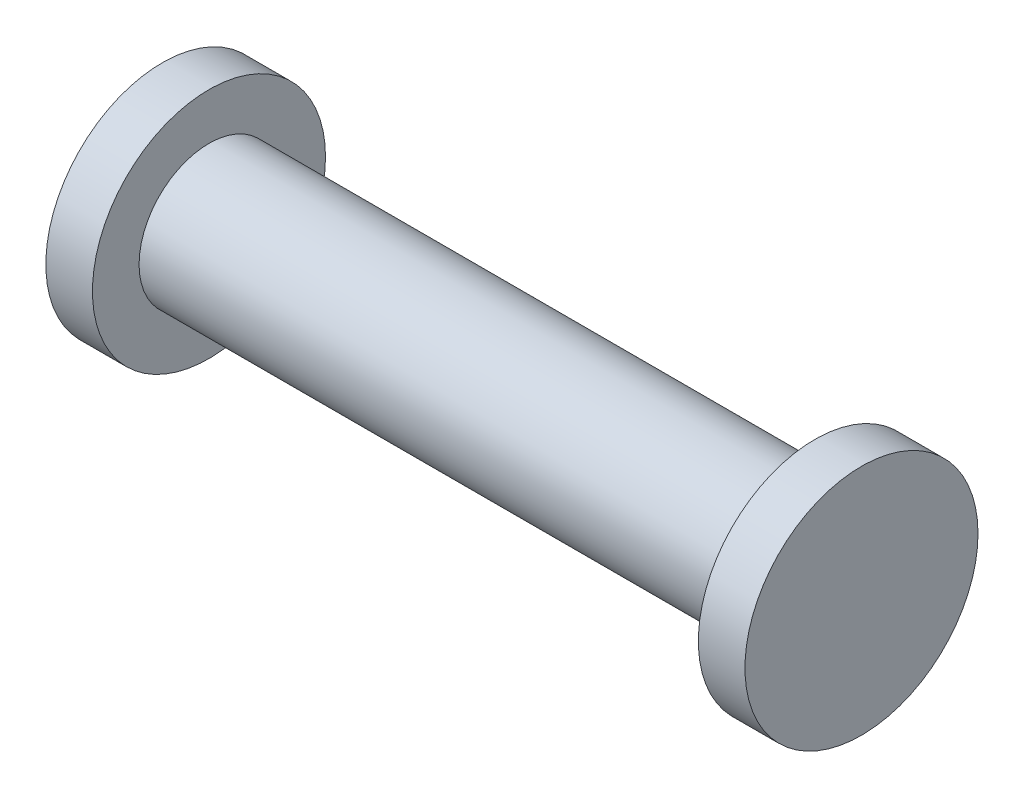
ISO-10303-21;
HEADER;
FILE_DESCRIPTION(('STEP AP214'),'2;1');
FILE_NAME('part.step','',(''),(''),'','','');
FILE_SCHEMA(('AUTOMOTIVE_DESIGN { 1 0 10303 214 1 1 1 1 }'));
ENDSEC;
DATA;
#1=APPLICATION_CONTEXT('core data for automotive mechanical design processes');
#2=APPLICATION_PROTOCOL_DEFINITION('international standard','automotive_design',2000,#1);
#3=PRODUCT_CONTEXT('',#1,'mechanical');
#4=PRODUCT('Part','Part','',(#3));
#5=PRODUCT_RELATED_PRODUCT_CATEGORY('part','',(#4));
#6=PRODUCT_DEFINITION_FORMATION('','',#4);
#7=PRODUCT_DEFINITION_CONTEXT('part definition',#1,'design');
#8=PRODUCT_DEFINITION('design','',#6,#7);
#9=PRODUCT_DEFINITION_SHAPE('','',#8);
#10=(LENGTH_UNIT() NAMED_UNIT(*) SI_UNIT(.MILLI.,.METRE.));
#11=(NAMED_UNIT(*) PLANE_ANGLE_UNIT() SI_UNIT($,.RADIAN.));
#12=(NAMED_UNIT(*) SI_UNIT($,.STERADIAN.) SOLID_ANGLE_UNIT());
#13=UNCERTAINTY_MEASURE_WITH_UNIT(LENGTH_MEASURE(1.E-05),#10,'distance_accuracy_value','');
#14=(GEOMETRIC_REPRESENTATION_CONTEXT(3) GLOBAL_UNCERTAINTY_ASSIGNED_CONTEXT((#13)) GLOBAL_UNIT_ASSIGNED_CONTEXT((#10,
#11,#12)) REPRESENTATION_CONTEXT('',''));
#15=CARTESIAN_POINT('',(0.,0.,0.));
#16=DIRECTION('',(0.,0.,1.));
#17=DIRECTION('',(1.,0.,0.));
#18=AXIS2_PLACEMENT_3D('',#15,#16,#17);
#19=CARTESIAN_POINT('',(32.5,0.,0.));
#20=DIRECTION('',(-1.,0.,0.));
#21=DIRECTION('',(0.,0.,1.));
#22=AXIS2_PLACEMENT_3D('',#19,#20,#21);
#23=CYLINDRICAL_SURFACE('',#22,7.5);
#24=CARTESIAN_POINT('',(32.5,0.,0.));
#25=DIRECTION('',(1.,0.,0.));
#26=DIRECTION('',(0.,0.,-1.));
#27=AXIS2_PLACEMENT_3D('',#24,#25,#26);
#28=CIRCLE('',#27,7.5);
#29=CARTESIAN_POINT('',(32.5,0.,-7.5));
#30=VERTEX_POINT('',#29);
#31=EDGE_CURVE('E10',#30,#30,#28,.T.);
#32=ORIENTED_EDGE('',*,*,#31,.F.);
#33=EDGE_LOOP('',(#32));
#34=FACE_BOUND('',#33,.T.);
#35=CARTESIAN_POINT('',(-32.5,0.,0.));
#36=DIRECTION('',(-1.,0.,0.));
#37=DIRECTION('',(0.,0.,1.));
#38=AXIS2_PLACEMENT_3D('',#35,#36,#37);
#39=CIRCLE('',#38,7.5);
#40=CARTESIAN_POINT('',(-32.5,0.,7.5));
#41=VERTEX_POINT('',#40);
#42=EDGE_CURVE('E45',#41,#41,#39,.T.);
#43=ORIENTED_EDGE('',*,*,#42,.F.);
#44=EDGE_LOOP('',(#43));
#45=FACE_BOUND('',#44,.T.);
#46=ADVANCED_FACE('F30',(#34,#45),#23,.T.);
#47=CARTESIAN_POINT('',(37.5,0.,0.));
#48=DIRECTION('',(-1.,0.,0.));
#49=DIRECTION('',(0.,0.,1.));
#50=AXIS2_PLACEMENT_3D('',#47,#48,#49);
#51=CYLINDRICAL_SURFACE('',#50,12.5);
#52=CARTESIAN_POINT('',(37.5,0.,0.));
#53=DIRECTION('',(1.,0.,0.));
#54=DIRECTION('',(0.,0.,-1.));
#55=AXIS2_PLACEMENT_3D('',#52,#53,#54);
#56=CIRCLE('',#55,12.5);
#57=CARTESIAN_POINT('',(37.5,0.,-12.5));
#58=VERTEX_POINT('',#57);
#59=EDGE_CURVE('E36',#58,#58,#56,.T.);
#60=ORIENTED_EDGE('',*,*,#59,.F.);
#61=EDGE_LOOP('',(#60));
#62=FACE_BOUND('',#61,.T.);
#63=CARTESIAN_POINT('',(32.5,0.,0.));
#64=DIRECTION('',(1.,0.,0.));
#65=DIRECTION('',(0.,0.,-1.));
#66=AXIS2_PLACEMENT_3D('',#63,#64,#65);
#67=CIRCLE('',#66,12.5);
#68=CARTESIAN_POINT('',(32.5,0.,-12.5));
#69=VERTEX_POINT('',#68);
#70=EDGE_CURVE('E40',#69,#69,#67,.T.);
#71=ORIENTED_EDGE('',*,*,#70,.T.);
#72=EDGE_LOOP('',(#71));
#73=FACE_BOUND('',#72,.T.);
#74=ADVANCED_FACE('F72',(#62,#73),#51,.T.);
#75=CARTESIAN_POINT('',(37.5,0.,0.));
#76=DIRECTION('',(1.,0.,0.));
#77=DIRECTION('',(0.,0.,-1.));
#78=AXIS2_PLACEMENT_3D('',#75,#76,#77);
#79=PLANE('',#78);
#80=ORIENTED_EDGE('',*,*,#59,.T.);
#81=EDGE_LOOP('',(#80));
#82=FACE_BOUND('',#81,.T.);
#83=ADVANCED_FACE('F77',(#82),#79,.T.);
#84=CARTESIAN_POINT('',(32.5,0.,0.));
#85=DIRECTION('',(1.,0.,0.));
#86=DIRECTION('',(0.,0.,-1.));
#87=AXIS2_PLACEMENT_3D('',#84,#85,#86);
#88=PLANE('',#87);
#89=ORIENTED_EDGE('',*,*,#31,.T.);
#90=EDGE_LOOP('',(#89));
#91=FACE_BOUND('',#90,.T.);
#92=ORIENTED_EDGE('',*,*,#70,.F.);
#93=EDGE_LOOP('',(#92));
#94=FACE_BOUND('',#93,.T.);
#95=ADVANCED_FACE('F69',(#91,#94),#88,.F.);
#96=CARTESIAN_POINT('',(-37.5,0.,0.));
#97=DIRECTION('',(1.,0.,0.));
#98=DIRECTION('',(0.,0.,-1.));
#99=AXIS2_PLACEMENT_3D('',#96,#97,#98);
#100=CYLINDRICAL_SURFACE('',#99,12.5);
#101=CARTESIAN_POINT('',(-37.5,0.,0.));
#102=DIRECTION('',(1.,0.,0.));
#103=DIRECTION('',(0.,0.,-1.));
#104=AXIS2_PLACEMENT_3D('',#101,#102,#103);
#105=CIRCLE('',#104,12.5);
#106=CARTESIAN_POINT('',(-37.5,0.,-12.5));
#107=VERTEX_POINT('',#106);
#108=EDGE_CURVE('E49',#107,#107,#105,.T.);
#109=ORIENTED_EDGE('',*,*,#108,.T.);
#110=EDGE_LOOP('',(#109));
#111=FACE_BOUND('',#110,.T.);
#112=CARTESIAN_POINT('',(-32.5,0.,0.));
#113=DIRECTION('',(1.,0.,0.));
#114=DIRECTION('',(0.,0.,-1.));
#115=AXIS2_PLACEMENT_3D('',#112,#113,#114);
#116=CIRCLE('',#115,12.5);
#117=CARTESIAN_POINT('',(-32.5,0.,-12.5));
#118=VERTEX_POINT('',#117);
#119=EDGE_CURVE('E50',#118,#118,#116,.T.);
#120=ORIENTED_EDGE('',*,*,#119,.F.);
#121=EDGE_LOOP('',(#120));
#122=FACE_BOUND('',#121,.T.);
#123=ADVANCED_FACE('F56',(#111,#122),#100,.T.);
#124=CARTESIAN_POINT('',(-37.5,0.,0.));
#125=DIRECTION('',(-1.,0.,0.));
#126=DIRECTION('',(0.,0.,-1.));
#127=AXIS2_PLACEMENT_3D('',#124,#125,#126);
#128=PLANE('',#127);
#129=ORIENTED_EDGE('',*,*,#108,.F.);
#130=EDGE_LOOP('',(#129));
#131=FACE_BOUND('',#130,.T.);
#132=ADVANCED_FACE('F59',(#131),#128,.T.);
#133=CARTESIAN_POINT('',(-32.5,0.,0.));
#134=DIRECTION('',(-1.,0.,0.));
#135=DIRECTION('',(0.,0.,-1.));
#136=AXIS2_PLACEMENT_3D('',#133,#134,#135);
#137=PLANE('',#136);
#138=ORIENTED_EDGE('',*,*,#42,.T.);
#139=EDGE_LOOP('',(#138));
#140=FACE_BOUND('',#139,.T.);
#141=ORIENTED_EDGE('',*,*,#119,.T.);
#142=EDGE_LOOP('',(#141));
#143=FACE_BOUND('',#142,.T.);
#144=ADVANCED_FACE('F61',(#140,#143),#137,.F.);
#145=CLOSED_SHELL('',(#46,#74,#83,#95,#123,#132,#144));
#146=MANIFOLD_SOLID_BREP('B2',#145);
#147=ADVANCED_BREP_SHAPE_REPRESENTATION('',(#18,#146),#14);
#148=SHAPE_DEFINITION_REPRESENTATION(#9,#147);
ENDSEC;
END-ISO-10303-21;
